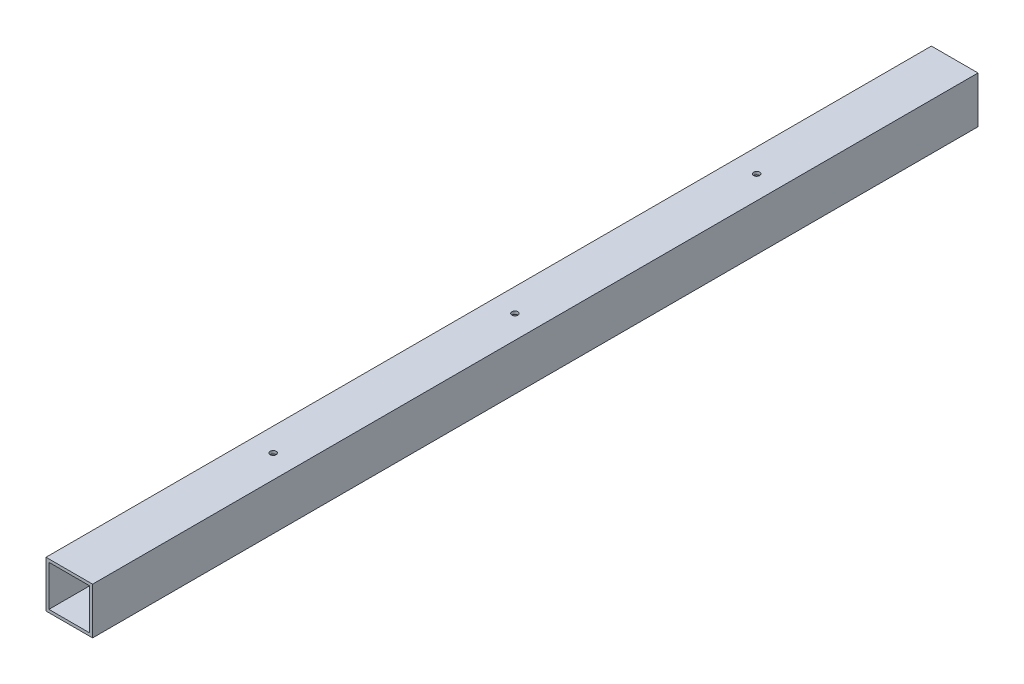
ISO-10303-21;
HEADER;
FILE_DESCRIPTION(('STEP AP214'),'2;1');
FILE_NAME('part.step','',(''),(''),'','','');
FILE_SCHEMA(('AUTOMOTIVE_DESIGN { 1 0 10303 214 1 1 1 1 }'));
ENDSEC;
DATA;
#1=APPLICATION_CONTEXT('core data for automotive mechanical design processes');
#2=APPLICATION_PROTOCOL_DEFINITION('international standard','automotive_design',2000,#1);
#3=PRODUCT_CONTEXT('',#1,'mechanical');
#4=PRODUCT('Part','Part','',(#3));
#5=PRODUCT_RELATED_PRODUCT_CATEGORY('part','',(#4));
#6=PRODUCT_DEFINITION_FORMATION('','',#4);
#7=PRODUCT_DEFINITION_CONTEXT('part definition',#1,'design');
#8=PRODUCT_DEFINITION('design','',#6,#7);
#9=PRODUCT_DEFINITION_SHAPE('','',#8);
#10=(LENGTH_UNIT() NAMED_UNIT(*) SI_UNIT(.MILLI.,.METRE.));
#11=(NAMED_UNIT(*) PLANE_ANGLE_UNIT() SI_UNIT($,.RADIAN.));
#12=(NAMED_UNIT(*) SI_UNIT($,.STERADIAN.) SOLID_ANGLE_UNIT());
#13=UNCERTAINTY_MEASURE_WITH_UNIT(LENGTH_MEASURE(1.E-05),#10,'distance_accuracy_value','');
#14=(GEOMETRIC_REPRESENTATION_CONTEXT(3) GLOBAL_UNCERTAINTY_ASSIGNED_CONTEXT((#13)) GLOBAL_UNIT_ASSIGNED_CONTEXT((#10,
#11,#12)) REPRESENTATION_CONTEXT('',''));
#15=CARTESIAN_POINT('',(0.,0.,0.));
#16=DIRECTION('',(0.,0.,1.));
#17=DIRECTION('',(1.,0.,0.));
#18=AXIS2_PLACEMENT_3D('',#15,#16,#17);
#19=CARTESIAN_POINT('',(-3.33066907387547E-13,0.,965.2));
#20=DIRECTION('',(0.,0.,-1.));
#21=DIRECTION('',(-1.,0.,0.));
#22=AXIS2_PLACEMENT_3D('',#19,#20,#21);
#23=PLANE('',#22);
#24=DIRECTION('',(0.,-1.,0.));
#25=VECTOR('',#24,1.);
#26=CARTESIAN_POINT('',(-25.4000000000001,3.05311331771918E-13,965.2));
#27=LINE('',#26,#25);
#28=CARTESIAN_POINT('',(-25.4000000000001,50.8000000000003,965.2));
#29=VERTEX_POINT('',#28);
#30=CARTESIAN_POINT('',(-25.4000000000001,3.05311331771918E-13,965.2));
#31=VERTEX_POINT('',#30);
#32=EDGE_CURVE('E141',#29,#31,#27,.T.);
#33=ORIENTED_EDGE('',*,*,#32,.T.);
#34=DIRECTION('',(1.,0.,0.));
#35=VECTOR('',#34,1.);
#36=CARTESIAN_POINT('',(-25.4000000000001,3.05311331771918E-13,965.2));
#37=LINE('',#36,#35);
#38=CARTESIAN_POINT('',(25.4,0.,965.2));
#39=VERTEX_POINT('',#38);
#40=EDGE_CURVE('E144',#31,#39,#37,.T.);
#41=ORIENTED_EDGE('',*,*,#40,.T.);
#42=DIRECTION('',(0.,1.,0.));
#43=VECTOR('',#42,1.);
#44=CARTESIAN_POINT('',(25.4,0.,965.2));
#45=LINE('',#44,#43);
#46=CARTESIAN_POINT('',(25.4,50.8000000000003,965.2));
#47=VERTEX_POINT('',#46);
#48=EDGE_CURVE('E147',#39,#47,#45,.T.);
#49=ORIENTED_EDGE('',*,*,#48,.T.);
#50=DIRECTION('',(-1.,0.,0.));
#51=VECTOR('',#50,1.);
#52=CARTESIAN_POINT('',(-25.4000000000001,50.8000000000003,965.2));
#53=LINE('',#52,#51);
#54=EDGE_CURVE('E149',#47,#29,#53,.T.);
#55=ORIENTED_EDGE('',*,*,#54,.T.);
#56=EDGE_LOOP('',(#33,#41,#49,#55));
#57=FACE_BOUND('',#56,.T.);
#58=DIRECTION('',(1.,0.,0.));
#59=VECTOR('',#58,1.);
#60=CARTESIAN_POINT('',(-22.2250000000001,3.17500000000032,965.2));
#61=LINE('',#60,#59);
#62=CARTESIAN_POINT('',(-22.2250000000001,3.17500000000032,965.2));
#63=VERTEX_POINT('',#62);
#64=CARTESIAN_POINT('',(22.2249999999998,3.17500000000032,965.2));
#65=VERTEX_POINT('',#64);
#66=EDGE_CURVE('E103',#63,#65,#61,.T.);
#67=ORIENTED_EDGE('',*,*,#66,.F.);
#68=DIRECTION('',(0.,-1.,0.));
#69=VECTOR('',#68,1.);
#70=CARTESIAN_POINT('',(-22.2250000000001,3.17500000000032,965.2));
#71=LINE('',#70,#69);
#72=CARTESIAN_POINT('',(-22.2250000000001,47.6250000000003,965.2));
#73=VERTEX_POINT('',#72);
#74=EDGE_CURVE('E125',#73,#63,#71,.T.);
#75=ORIENTED_EDGE('',*,*,#74,.F.);
#76=DIRECTION('',(-1.,0.,0.));
#77=VECTOR('',#76,1.);
#78=CARTESIAN_POINT('',(-22.2250000000001,47.6250000000003,965.2));
#79=LINE('',#78,#77);
#80=CARTESIAN_POINT('',(22.2249999999998,47.6250000000003,965.2));
#81=VERTEX_POINT('',#80);
#82=EDGE_CURVE('E123',#81,#73,#79,.T.);
#83=ORIENTED_EDGE('',*,*,#82,.F.);
#84=DIRECTION('',(0.,1.,0.));
#85=VECTOR('',#84,1.);
#86=CARTESIAN_POINT('',(22.2249999999998,3.17500000000032,965.2));
#87=LINE('',#86,#85);
#88=EDGE_CURVE('E111',#65,#81,#87,.T.);
#89=ORIENTED_EDGE('',*,*,#88,.F.);
#90=EDGE_LOOP('',(#67,#75,#83,#89));
#91=FACE_BOUND('',#90,.T.);
#92=ADVANCED_FACE('F36',(#57,#91),#23,.F.);
#93=CARTESIAN_POINT('',(0.,0.,0.));
#94=DIRECTION('',(0.,0.,-1.));
#95=DIRECTION('',(-1.,0.,0.));
#96=AXIS2_PLACEMENT_3D('',#93,#94,#95);
#97=PLANE('',#96);
#98=DIRECTION('',(0.,-1.,0.));
#99=VECTOR('',#98,1.);
#100=CARTESIAN_POINT('',(-25.4000000000001,3.05311331771918E-13,0.));
#101=LINE('',#100,#99);
#102=CARTESIAN_POINT('',(-25.4000000000001,50.8000000000003,0.));
#103=VERTEX_POINT('',#102);
#104=CARTESIAN_POINT('',(-25.4000000000001,3.05311331771918E-13,0.));
#105=VERTEX_POINT('',#104);
#106=EDGE_CURVE('E119',#103,#105,#101,.T.);
#107=ORIENTED_EDGE('',*,*,#106,.F.);
#108=DIRECTION('',(-1.,0.,0.));
#109=VECTOR('',#108,1.);
#110=CARTESIAN_POINT('',(-25.4000000000001,50.8000000000003,0.));
#111=LINE('',#110,#109);
#112=CARTESIAN_POINT('',(25.4000000000001,50.8000000000003,0.));
#113=VERTEX_POINT('',#112);
#114=EDGE_CURVE('E145',#113,#103,#111,.T.);
#115=ORIENTED_EDGE('',*,*,#114,.F.);
#116=DIRECTION('',(0.,1.,0.));
#117=VECTOR('',#116,1.);
#118=CARTESIAN_POINT('',(25.4000000000001,0.,0.));
#119=LINE('',#118,#117);
#120=CARTESIAN_POINT('',(25.4000000000001,0.,0.));
#121=VERTEX_POINT('',#120);
#122=EDGE_CURVE('E156',#121,#113,#119,.T.);
#123=ORIENTED_EDGE('',*,*,#122,.F.);
#124=DIRECTION('',(1.,0.,0.));
#125=VECTOR('',#124,1.);
#126=CARTESIAN_POINT('',(-25.4000000000001,3.05311331771918E-13,0.));
#127=LINE('',#126,#125);
#128=EDGE_CURVE('E154',#105,#121,#127,.T.);
#129=ORIENTED_EDGE('',*,*,#128,.F.);
#130=EDGE_LOOP('',(#107,#115,#123,#129));
#131=FACE_BOUND('',#130,.T.);
#132=DIRECTION('',(0.,-1.,0.));
#133=VECTOR('',#132,1.);
#134=CARTESIAN_POINT('',(-22.2249999999999,3.17500000000032,0.));
#135=LINE('',#134,#133);
#136=CARTESIAN_POINT('',(-22.2249999999999,47.6250000000003,0.));
#137=VERTEX_POINT('',#136);
#138=CARTESIAN_POINT('',(-22.2249999999999,3.17500000000032,0.));
#139=VERTEX_POINT('',#138);
#140=EDGE_CURVE('E112',#137,#139,#135,.T.);
#141=ORIENTED_EDGE('',*,*,#140,.T.);
#142=DIRECTION('',(1.,0.,0.));
#143=VECTOR('',#142,1.);
#144=CARTESIAN_POINT('',(-22.2249999999999,3.17500000000032,0.));
#145=LINE('',#144,#143);
#146=CARTESIAN_POINT('',(22.2249999999999,3.17500000000032,0.));
#147=VERTEX_POINT('',#146);
#148=EDGE_CURVE('E61',#139,#147,#145,.T.);
#149=ORIENTED_EDGE('',*,*,#148,.T.);
#150=DIRECTION('',(0.,1.,0.));
#151=VECTOR('',#150,1.);
#152=CARTESIAN_POINT('',(22.2249999999999,3.17500000000032,0.));
#153=LINE('',#152,#151);
#154=CARTESIAN_POINT('',(22.2249999999999,47.6250000000003,0.));
#155=VERTEX_POINT('',#154);
#156=EDGE_CURVE('E118',#147,#155,#153,.T.);
#157=ORIENTED_EDGE('',*,*,#156,.T.);
#158=DIRECTION('',(-1.,0.,0.));
#159=VECTOR('',#158,1.);
#160=CARTESIAN_POINT('',(-22.2249999999999,47.6250000000003,0.));
#161=LINE('',#160,#159);
#162=EDGE_CURVE('E133',#155,#137,#161,.T.);
#163=ORIENTED_EDGE('',*,*,#162,.T.);
#164=EDGE_LOOP('',(#141,#149,#157,#163));
#165=FACE_BOUND('',#164,.T.);
#166=ADVANCED_FACE('F203',(#131,#165),#97,.T.);
#167=CARTESIAN_POINT('',(-25.4000000000001,3.05311331771918E-13,965.2));
#168=DIRECTION('',(1.,0.,0.));
#169=DIRECTION('',(0.,0.,-1.));
#170=AXIS2_PLACEMENT_3D('',#167,#168,#169);
#171=PLANE('',#170);
#172=ORIENTED_EDGE('',*,*,#106,.T.);
#173=DIRECTION('',(0.,0.,-1.));
#174=VECTOR('',#173,1.);
#175=CARTESIAN_POINT('',(-25.4000000000001,3.05311331771918E-13,965.2));
#176=LINE('',#175,#174);
#177=EDGE_CURVE('E11',#31,#105,#176,.T.);
#178=ORIENTED_EDGE('',*,*,#177,.F.);
#179=ORIENTED_EDGE('',*,*,#32,.F.);
#180=DIRECTION('',(0.,0.,-1.));
#181=VECTOR('',#180,1.);
#182=CARTESIAN_POINT('',(-25.4000000000001,50.8000000000003,965.2));
#183=LINE('',#182,#181);
#184=EDGE_CURVE('E151',#29,#103,#183,.T.);
#185=ORIENTED_EDGE('',*,*,#184,.T.);
#186=EDGE_LOOP('',(#172,#178,#179,#185));
#187=FACE_BOUND('',#186,.T.);
#188=ADVANCED_FACE('F38',(#187),#171,.F.);
#189=CARTESIAN_POINT('',(-25.4000000000001,3.05311331771918E-13,965.2));
#190=DIRECTION('',(0.,1.,0.));
#191=DIRECTION('',(-1.,0.,0.));
#192=AXIS2_PLACEMENT_3D('',#189,#190,#191);
#193=PLANE('',#192);
#194=CARTESIAN_POINT('',(-3.33066907387547E-13,0.,215.9));
#195=DIRECTION('',(0.,1.,0.));
#196=DIRECTION('',(0.,0.,1.));
#197=AXIS2_PLACEMENT_3D('',#194,#195,#196);
#198=CIRCLE('',#197,3.302);
#199=CARTESIAN_POINT('',(-3.33066907387547E-13,0.,219.202));
#200=VERTEX_POINT('',#199);
#201=EDGE_CURVE('E169',#200,#200,#198,.T.);
#202=ORIENTED_EDGE('',*,*,#201,.T.);
#203=EDGE_LOOP('',(#202));
#204=FACE_BOUND('',#203,.T.);
#205=CARTESIAN_POINT('',(0.,0.,479.425));
#206=DIRECTION('',(0.,1.,0.));
#207=DIRECTION('',(0.,0.,1.));
#208=AXIS2_PLACEMENT_3D('',#205,#206,#207);
#209=CIRCLE('',#208,3.302);
#210=CARTESIAN_POINT('',(0.,0.,482.727));
#211=VERTEX_POINT('',#210);
#212=EDGE_CURVE('E245',#211,#211,#209,.T.);
#213=ORIENTED_EDGE('',*,*,#212,.T.);
#214=EDGE_LOOP('',(#213));
#215=FACE_BOUND('',#214,.T.);
#216=CARTESIAN_POINT('',(-3.33066907387547E-13,0.,742.95));
#217=DIRECTION('',(0.,1.,0.));
#218=DIRECTION('',(0.,0.,1.));
#219=AXIS2_PLACEMENT_3D('',#216,#217,#218);
#220=CIRCLE('',#219,3.30200000000003);
#221=CARTESIAN_POINT('',(-3.33066907387547E-13,0.,746.252));
#222=VERTEX_POINT('',#221);
#223=EDGE_CURVE('E249',#222,#222,#220,.T.);
#224=ORIENTED_EDGE('',*,*,#223,.T.);
#225=EDGE_LOOP('',(#224));
#226=FACE_BOUND('',#225,.T.);
#227=ORIENTED_EDGE('',*,*,#128,.T.);
#228=DIRECTION('',(0.,0.,-1.));
#229=VECTOR('',#228,1.);
#230=CARTESIAN_POINT('',(25.4,0.,965.2));
#231=LINE('',#230,#229);
#232=EDGE_CURVE('E45',#39,#121,#231,.T.);
#233=ORIENTED_EDGE('',*,*,#232,.F.);
#234=ORIENTED_EDGE('',*,*,#40,.F.);
#235=ORIENTED_EDGE('',*,*,#177,.T.);
#236=EDGE_LOOP('',(#227,#233,#234,#235));
#237=FACE_BOUND('',#236,.T.);
#238=ADVANCED_FACE('F231',(#204,#215,#226,#237),#193,.F.);
#239=CARTESIAN_POINT('',(25.4,0.,965.2));
#240=DIRECTION('',(-1.,0.,0.));
#241=DIRECTION('',(0.,0.,1.));
#242=AXIS2_PLACEMENT_3D('',#239,#240,#241);
#243=PLANE('',#242);
#244=ORIENTED_EDGE('',*,*,#122,.T.);
#245=DIRECTION('',(0.,0.,-1.));
#246=VECTOR('',#245,1.);
#247=CARTESIAN_POINT('',(25.4,50.8000000000003,965.2));
#248=LINE('',#247,#246);
#249=EDGE_CURVE('E161',#47,#113,#248,.T.);
#250=ORIENTED_EDGE('',*,*,#249,.F.);
#251=ORIENTED_EDGE('',*,*,#48,.F.);
#252=ORIENTED_EDGE('',*,*,#232,.T.);
#253=EDGE_LOOP('',(#244,#250,#251,#252));
#254=FACE_BOUND('',#253,.T.);
#255=ADVANCED_FACE('F228',(#254),#243,.F.);
#256=CARTESIAN_POINT('',(-25.4000000000001,50.8000000000003,965.2));
#257=DIRECTION('',(0.,-1.,0.));
#258=DIRECTION('',(0.,0.,-1.));
#259=AXIS2_PLACEMENT_3D('',#256,#257,#258);
#260=PLANE('',#259);
#261=CARTESIAN_POINT('',(-3.33066907387547E-13,50.8000000000003,215.9));
#262=DIRECTION('',(0.,1.,0.));
#263=DIRECTION('',(0.,0.,1.));
#264=AXIS2_PLACEMENT_3D('',#261,#262,#263);
#265=CIRCLE('',#264,3.302);
#266=CARTESIAN_POINT('',(-3.33066907387547E-13,50.8000000000003,219.202));
#267=VERTEX_POINT('',#266);
#268=EDGE_CURVE('E268',#267,#267,#265,.T.);
#269=ORIENTED_EDGE('',*,*,#268,.F.);
#270=EDGE_LOOP('',(#269));
#271=FACE_BOUND('',#270,.T.);
#272=CARTESIAN_POINT('',(0.,50.8000000000003,479.425));
#273=DIRECTION('',(0.,1.,0.));
#274=DIRECTION('',(0.,0.,1.));
#275=AXIS2_PLACEMENT_3D('',#272,#273,#274);
#276=CIRCLE('',#275,3.302);
#277=CARTESIAN_POINT('',(0.,50.8000000000003,482.727));
#278=VERTEX_POINT('',#277);
#279=EDGE_CURVE('E262',#278,#278,#276,.T.);
#280=ORIENTED_EDGE('',*,*,#279,.F.);
#281=EDGE_LOOP('',(#280));
#282=FACE_BOUND('',#281,.T.);
#283=CARTESIAN_POINT('',(-3.33066907387547E-13,50.8000000000003,742.95));
#284=DIRECTION('',(0.,1.,0.));
#285=DIRECTION('',(0.,0.,1.));
#286=AXIS2_PLACEMENT_3D('',#283,#284,#285);
#287=CIRCLE('',#286,3.30200000000003);
#288=CARTESIAN_POINT('',(-3.33066907387547E-13,50.8000000000003,746.252));
#289=VERTEX_POINT('',#288);
#290=EDGE_CURVE('E182',#289,#289,#287,.T.);
#291=ORIENTED_EDGE('',*,*,#290,.F.);
#292=EDGE_LOOP('',(#291));
#293=FACE_BOUND('',#292,.T.);
#294=ORIENTED_EDGE('',*,*,#114,.T.);
#295=ORIENTED_EDGE('',*,*,#184,.F.);
#296=ORIENTED_EDGE('',*,*,#54,.F.);
#297=ORIENTED_EDGE('',*,*,#249,.T.);
#298=EDGE_LOOP('',(#294,#295,#296,#297));
#299=FACE_BOUND('',#298,.T.);
#300=ADVANCED_FACE('F225',(#271,#282,#293,#299),#260,.F.);
#301=CARTESIAN_POINT('',(-22.2250000000001,3.17500000000032,965.2));
#302=DIRECTION('',(0.,1.,0.));
#303=DIRECTION('',(0.,0.,1.));
#304=AXIS2_PLACEMENT_3D('',#301,#302,#303);
#305=PLANE('',#304);
#306=CARTESIAN_POINT('',(-3.33066907387547E-13,3.17500000000032,215.9));
#307=DIRECTION('',(0.,1.,0.));
#308=DIRECTION('',(0.,0.,1.));
#309=AXIS2_PLACEMENT_3D('',#306,#307,#308);
#310=CIRCLE('',#309,3.302);
#311=CARTESIAN_POINT('',(-3.33066907387547E-13,3.17500000000032,219.202));
#312=VERTEX_POINT('',#311);
#313=EDGE_CURVE('E131',#312,#312,#310,.T.);
#314=ORIENTED_EDGE('',*,*,#313,.F.);
#315=EDGE_LOOP('',(#314));
#316=FACE_BOUND('',#315,.T.);
#317=CARTESIAN_POINT('',(0.,3.17500000000032,479.425));
#318=DIRECTION('',(0.,1.,0.));
#319=DIRECTION('',(0.,0.,1.));
#320=AXIS2_PLACEMENT_3D('',#317,#318,#319);
#321=CIRCLE('',#320,3.302);
#322=CARTESIAN_POINT('',(0.,3.17500000000032,482.727));
#323=VERTEX_POINT('',#322);
#324=EDGE_CURVE('E172',#323,#323,#321,.T.);
#325=ORIENTED_EDGE('',*,*,#324,.F.);
#326=EDGE_LOOP('',(#325));
#327=FACE_BOUND('',#326,.T.);
#328=CARTESIAN_POINT('',(-3.33066907387547E-13,3.17500000000032,742.95));
#329=DIRECTION('',(0.,1.,0.));
#330=DIRECTION('',(0.,0.,1.));
#331=AXIS2_PLACEMENT_3D('',#328,#329,#330);
#332=CIRCLE('',#331,3.30200000000003);
#333=CARTESIAN_POINT('',(-3.33066907387547E-13,3.17500000000032,746.252));
#334=VERTEX_POINT('',#333);
#335=EDGE_CURVE('E168',#334,#334,#332,.T.);
#336=ORIENTED_EDGE('',*,*,#335,.F.);
#337=EDGE_LOOP('',(#336));
#338=FACE_BOUND('',#337,.T.);
#339=ORIENTED_EDGE('',*,*,#148,.F.);
#340=DIRECTION('',(0.,0.,-1.));
#341=VECTOR('',#340,1.);
#342=CARTESIAN_POINT('',(-22.2250000000001,3.17500000000032,965.2));
#343=LINE('',#342,#341);
#344=EDGE_CURVE('E107',#63,#139,#343,.T.);
#345=ORIENTED_EDGE('',*,*,#344,.F.);
#346=ORIENTED_EDGE('',*,*,#66,.T.);
#347=DIRECTION('',(0.,0.,-1.));
#348=VECTOR('',#347,1.);
#349=CARTESIAN_POINT('',(22.2249999999998,3.17500000000032,965.2));
#350=LINE('',#349,#348);
#351=EDGE_CURVE('E106',#65,#147,#350,.T.);
#352=ORIENTED_EDGE('',*,*,#351,.T.);
#353=EDGE_LOOP('',(#339,#345,#346,#352));
#354=FACE_BOUND('',#353,.T.);
#355=ADVANCED_FACE('F105',(#316,#327,#338,#354),#305,.T.);
#356=CARTESIAN_POINT('',(22.2249999999998,3.17500000000032,965.2));
#357=DIRECTION('',(-1.,0.,0.));
#358=DIRECTION('',(0.,-1.,0.));
#359=AXIS2_PLACEMENT_3D('',#356,#357,#358);
#360=PLANE('',#359);
#361=ORIENTED_EDGE('',*,*,#156,.F.);
#362=ORIENTED_EDGE('',*,*,#351,.F.);
#363=ORIENTED_EDGE('',*,*,#88,.T.);
#364=DIRECTION('',(0.,0.,-1.));
#365=VECTOR('',#364,1.);
#366=CARTESIAN_POINT('',(22.2249999999998,47.6250000000003,965.2));
#367=LINE('',#366,#365);
#368=EDGE_CURVE('E120',#81,#155,#367,.T.);
#369=ORIENTED_EDGE('',*,*,#368,.T.);
#370=EDGE_LOOP('',(#361,#362,#363,#369));
#371=FACE_BOUND('',#370,.T.);
#372=ADVANCED_FACE('F115',(#371),#360,.T.);
#373=CARTESIAN_POINT('',(-22.2250000000001,47.6250000000003,965.2));
#374=DIRECTION('',(0.,-1.,0.));
#375=DIRECTION('',(0.,0.,-1.));
#376=AXIS2_PLACEMENT_3D('',#373,#374,#375);
#377=PLANE('',#376);
#378=CARTESIAN_POINT('',(-3.33066907387547E-13,47.6250000000003,215.9));
#379=DIRECTION('',(0.,-1.,0.));
#380=DIRECTION('',(0.,0.,-1.));
#381=AXIS2_PLACEMENT_3D('',#378,#379,#380);
#382=CIRCLE('',#381,3.302);
#383=CARTESIAN_POINT('',(-3.33066907387547E-13,47.6250000000003,212.598));
#384=VERTEX_POINT('',#383);
#385=EDGE_CURVE('E40',#384,#384,#382,.T.);
#386=ORIENTED_EDGE('',*,*,#385,.F.);
#387=EDGE_LOOP('',(#386));
#388=FACE_BOUND('',#387,.T.);
#389=CARTESIAN_POINT('',(0.,47.6250000000003,479.425));
#390=DIRECTION('',(0.,-1.,0.));
#391=DIRECTION('',(0.,0.,-1.));
#392=AXIS2_PLACEMENT_3D('',#389,#390,#391);
#393=CIRCLE('',#392,3.302);
#394=CARTESIAN_POINT('',(0.,47.6250000000003,476.123));
#395=VERTEX_POINT('',#394);
#396=EDGE_CURVE('E170',#395,#395,#393,.T.);
#397=ORIENTED_EDGE('',*,*,#396,.F.);
#398=EDGE_LOOP('',(#397));
#399=FACE_BOUND('',#398,.T.);
#400=CARTESIAN_POINT('',(-3.33066907387547E-13,47.6250000000003,742.95));
#401=DIRECTION('',(0.,-1.,0.));
#402=DIRECTION('',(0.,0.,-1.));
#403=AXIS2_PLACEMENT_3D('',#400,#401,#402);
#404=CIRCLE('',#403,3.30200000000003);
#405=CARTESIAN_POINT('',(-3.33066907387547E-13,47.6250000000003,739.648));
#406=VERTEX_POINT('',#405);
#407=EDGE_CURVE('E166',#406,#406,#404,.T.);
#408=ORIENTED_EDGE('',*,*,#407,.F.);
#409=EDGE_LOOP('',(#408));
#410=FACE_BOUND('',#409,.T.);
#411=ORIENTED_EDGE('',*,*,#162,.F.);
#412=ORIENTED_EDGE('',*,*,#368,.F.);
#413=ORIENTED_EDGE('',*,*,#82,.T.);
#414=DIRECTION('',(0.,0.,-1.));
#415=VECTOR('',#414,1.);
#416=CARTESIAN_POINT('',(-22.2250000000001,47.6250000000003,965.2));
#417=LINE('',#416,#415);
#418=EDGE_CURVE('E53',#73,#137,#417,.T.);
#419=ORIENTED_EDGE('',*,*,#418,.T.);
#420=EDGE_LOOP('',(#411,#412,#413,#419));
#421=FACE_BOUND('',#420,.T.);
#422=ADVANCED_FACE('F193',(#388,#399,#410,#421),#377,.T.);
#423=CARTESIAN_POINT('',(-22.2250000000001,3.17500000000032,965.2));
#424=DIRECTION('',(1.,0.,0.));
#425=DIRECTION('',(0.,0.,-1.));
#426=AXIS2_PLACEMENT_3D('',#423,#424,#425);
#427=PLANE('',#426);
#428=ORIENTED_EDGE('',*,*,#140,.F.);
#429=ORIENTED_EDGE('',*,*,#418,.F.);
#430=ORIENTED_EDGE('',*,*,#74,.T.);
#431=ORIENTED_EDGE('',*,*,#344,.T.);
#432=EDGE_LOOP('',(#428,#429,#430,#431));
#433=FACE_BOUND('',#432,.T.);
#434=ADVANCED_FACE('F196',(#433),#427,.T.);
#435=CARTESIAN_POINT('',(-3.33066907387547E-13,0.,742.95));
#436=DIRECTION('',(0.,1.,0.));
#437=DIRECTION('',(0.,0.,1.));
#438=AXIS2_PLACEMENT_3D('',#435,#436,#437);
#439=CYLINDRICAL_SURFACE('',#438,3.30200000000003);
#440=ORIENTED_EDGE('',*,*,#407,.T.);
#441=EDGE_LOOP('',(#440));
#442=FACE_BOUND('',#441,.T.);
#443=ORIENTED_EDGE('',*,*,#290,.T.);
#444=EDGE_LOOP('',(#443));
#445=FACE_BOUND('',#444,.T.);
#446=ADVANCED_FACE('F205',(#442,#445),#439,.F.);
#447=CARTESIAN_POINT('',(0.,0.,479.425));
#448=DIRECTION('',(0.,1.,0.));
#449=DIRECTION('',(0.,0.,1.));
#450=AXIS2_PLACEMENT_3D('',#447,#448,#449);
#451=CYLINDRICAL_SURFACE('',#450,3.302);
#452=ORIENTED_EDGE('',*,*,#396,.T.);
#453=EDGE_LOOP('',(#452));
#454=FACE_BOUND('',#453,.T.);
#455=ORIENTED_EDGE('',*,*,#279,.T.);
#456=EDGE_LOOP('',(#455));
#457=FACE_BOUND('',#456,.T.);
#458=ADVANCED_FACE('F210',(#454,#457),#451,.F.);
#459=CARTESIAN_POINT('',(-3.33066907387547E-13,0.,215.9));
#460=DIRECTION('',(0.,1.,0.));
#461=DIRECTION('',(0.,0.,1.));
#462=AXIS2_PLACEMENT_3D('',#459,#460,#461);
#463=CYLINDRICAL_SURFACE('',#462,3.302);
#464=ORIENTED_EDGE('',*,*,#385,.T.);
#465=EDGE_LOOP('',(#464));
#466=FACE_BOUND('',#465,.T.);
#467=ORIENTED_EDGE('',*,*,#268,.T.);
#468=EDGE_LOOP('',(#467));
#469=FACE_BOUND('',#468,.T.);
#470=ADVANCED_FACE('F190',(#466,#469),#463,.F.);
#471=ORIENTED_EDGE('',*,*,#335,.T.);
#472=EDGE_LOOP('',(#471));
#473=FACE_BOUND('',#472,.T.);
#474=ORIENTED_EDGE('',*,*,#223,.F.);
#475=EDGE_LOOP('',(#474));
#476=FACE_BOUND('',#475,.T.);
#477=ADVANCED_FACE('F213',(#473,#476),#439,.F.);
#478=ORIENTED_EDGE('',*,*,#324,.T.);
#479=EDGE_LOOP('',(#478));
#480=FACE_BOUND('',#479,.T.);
#481=ORIENTED_EDGE('',*,*,#212,.F.);
#482=EDGE_LOOP('',(#481));
#483=FACE_BOUND('',#482,.T.);
#484=ADVANCED_FACE('F280',(#480,#483),#451,.F.);
#485=ORIENTED_EDGE('',*,*,#313,.T.);
#486=EDGE_LOOP('',(#485));
#487=FACE_BOUND('',#486,.T.);
#488=ORIENTED_EDGE('',*,*,#201,.F.);
#489=EDGE_LOOP('',(#488));
#490=FACE_BOUND('',#489,.T.);
#491=ADVANCED_FACE('F285',(#487,#490),#463,.F.);
#492=CLOSED_SHELL('',(#92,#166,#188,#238,#255,#300,#355,#372,#422,#434,#446,#458,#470,#477,#484,#491));
#493=MANIFOLD_SOLID_BREP('B2',#492);
#494=ADVANCED_BREP_SHAPE_REPRESENTATION('',(#18,#493),#14);
#495=SHAPE_DEFINITION_REPRESENTATION(#9,#494);
ENDSEC;
END-ISO-10303-21;
